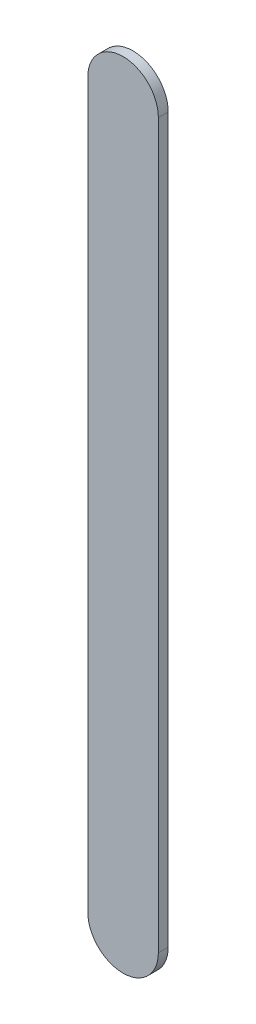
ISO-10303-21;
HEADER;
FILE_DESCRIPTION(('STEP AP214'),'2;1');
FILE_NAME('part.step','',(''),(''),'','','');
FILE_SCHEMA(('AUTOMOTIVE_DESIGN { 1 0 10303 214 1 1 1 1 }'));
ENDSEC;
DATA;
#1=APPLICATION_CONTEXT('core data for automotive mechanical design processes');
#2=APPLICATION_PROTOCOL_DEFINITION('international standard','automotive_design',2000,#1);
#3=PRODUCT_CONTEXT('',#1,'mechanical');
#4=PRODUCT('Part','Part','',(#3));
#5=PRODUCT_RELATED_PRODUCT_CATEGORY('part','',(#4));
#6=PRODUCT_DEFINITION_FORMATION('','',#4);
#7=PRODUCT_DEFINITION_CONTEXT('part definition',#1,'design');
#8=PRODUCT_DEFINITION('design','',#6,#7);
#9=PRODUCT_DEFINITION_SHAPE('','',#8);
#10=(LENGTH_UNIT() NAMED_UNIT(*) SI_UNIT(.MILLI.,.METRE.));
#11=(NAMED_UNIT(*) PLANE_ANGLE_UNIT() SI_UNIT($,.RADIAN.));
#12=(NAMED_UNIT(*) SI_UNIT($,.STERADIAN.) SOLID_ANGLE_UNIT());
#13=UNCERTAINTY_MEASURE_WITH_UNIT(LENGTH_MEASURE(1.E-05),#10,'distance_accuracy_value','');
#14=(GEOMETRIC_REPRESENTATION_CONTEXT(3) GLOBAL_UNCERTAINTY_ASSIGNED_CONTEXT((#13)) GLOBAL_UNIT_ASSIGNED_CONTEXT((#10,
#11,#12)) REPRESENTATION_CONTEXT('',''));
#15=CARTESIAN_POINT('',(0.,0.,0.));
#16=DIRECTION('',(0.,0.,1.));
#17=DIRECTION('',(1.,0.,0.));
#18=AXIS2_PLACEMENT_3D('',#15,#16,#17);
#19=CARTESIAN_POINT('',(90.6440148,97.48693228,0.));
#20=DIRECTION('',(-1.,0.,0.));
#21=DIRECTION('',(0.,1.,0.));
#22=AXIS2_PLACEMENT_3D('',#19,#20,#21);
#23=PLANE('',#22);
#24=DIRECTION('',(0.,1.,0.));
#25=VECTOR('',#24,1.);
#26=CARTESIAN_POINT('',(90.6440148,97.48693228,0.03556));
#27=LINE('',#26,#25);
#28=CARTESIAN_POINT('',(90.6440148,97.48693228,0.03556));
#29=VERTEX_POINT('',#28);
#30=CARTESIAN_POINT('',(90.6440148,100.0900208,0.03556));
#31=VERTEX_POINT('',#30);
#32=EDGE_CURVE('E11',#29,#31,#27,.T.);
#33=ORIENTED_EDGE('',*,*,#32,.F.);
#34=DIRECTION('',(0.,0.,1.));
#35=VECTOR('',#34,1.);
#36=CARTESIAN_POINT('',(90.6440148,97.48693228,0.));
#37=LINE('',#36,#35);
#38=CARTESIAN_POINT('',(90.6440148,97.48693228,0.));
#39=VERTEX_POINT('',#38);
#40=EDGE_CURVE('E24',#39,#29,#37,.T.);
#41=ORIENTED_EDGE('',*,*,#40,.F.);
#42=DIRECTION('',(0.,1.,0.));
#43=VECTOR('',#42,1.);
#44=CARTESIAN_POINT('',(90.6440148,97.48693228,0.));
#45=LINE('',#44,#43);
#46=CARTESIAN_POINT('',(90.6440148,100.0900208,0.));
#47=VERTEX_POINT('',#46);
#48=EDGE_CURVE('E75',#39,#47,#45,.T.);
#49=ORIENTED_EDGE('',*,*,#48,.T.);
#50=DIRECTION('',(0.,0.,1.));
#51=VECTOR('',#50,1.);
#52=CARTESIAN_POINT('',(90.6440148,100.0900208,0.));
#53=LINE('',#52,#51);
#54=EDGE_CURVE('E37',#47,#31,#53,.T.);
#55=ORIENTED_EDGE('',*,*,#54,.T.);
#56=EDGE_LOOP('',(#33,#41,#49,#55));
#57=FACE_BOUND('',#56,.T.);
#58=ADVANCED_FACE('F17',(#57),#23,.F.);
#59=CARTESIAN_POINT('',(90.5170148,100.0900208,0.));
#60=DIRECTION('',(0.,0.,-1.));
#61=DIRECTION('',(1.,1.11896493820492E-13,0.));
#62=AXIS2_PLACEMENT_3D('',#59,#60,#61);
#63=CYLINDRICAL_SURFACE('',#62,0.127000000000005);
#64=CARTESIAN_POINT('',(90.5170148,100.0900208,0.03556));
#65=DIRECTION('',(0.,0.,1.));
#66=DIRECTION('',(1.,1.11896493820492E-13,0.));
#67=AXIS2_PLACEMENT_3D('',#64,#65,#66);
#68=CIRCLE('',#67,0.127000000000005);
#69=CARTESIAN_POINT('',(90.3900148,100.0900208,0.03556));
#70=VERTEX_POINT('',#69);
#71=EDGE_CURVE('E83',#31,#70,#68,.T.);
#72=ORIENTED_EDGE('',*,*,#71,.F.);
#73=ORIENTED_EDGE('',*,*,#54,.F.);
#74=CARTESIAN_POINT('',(90.5170148,100.0900208,0.));
#75=DIRECTION('',(0.,0.,1.));
#76=DIRECTION('',(1.,1.11896493820492E-13,0.));
#77=AXIS2_PLACEMENT_3D('',#74,#75,#76);
#78=CIRCLE('',#77,0.127000000000005);
#79=CARTESIAN_POINT('',(90.3900148,100.0900208,0.));
#80=VERTEX_POINT('',#79);
#81=EDGE_CURVE('E81',#47,#80,#78,.T.);
#82=ORIENTED_EDGE('',*,*,#81,.T.);
#83=DIRECTION('',(0.,0.,1.));
#84=VECTOR('',#83,1.);
#85=CARTESIAN_POINT('',(90.3900148,100.0900208,0.));
#86=LINE('',#85,#84);
#87=EDGE_CURVE('E67',#80,#70,#86,.T.);
#88=ORIENTED_EDGE('',*,*,#87,.T.);
#89=EDGE_LOOP('',(#72,#73,#82,#88));
#90=FACE_BOUND('',#89,.T.);
#91=ADVANCED_FACE('F89',(#90),#63,.T.);
#92=CARTESIAN_POINT('',(90.3900148,100.0900208,0.));
#93=DIRECTION('',(1.,0.,0.));
#94=DIRECTION('',(0.,-1.,0.));
#95=AXIS2_PLACEMENT_3D('',#92,#93,#94);
#96=PLANE('',#95);
#97=DIRECTION('',(0.,-1.,0.));
#98=VECTOR('',#97,1.);
#99=CARTESIAN_POINT('',(90.3900148,100.0900208,0.03556));
#100=LINE('',#99,#98);
#101=CARTESIAN_POINT('',(90.3900148,97.48693228,0.03556));
#102=VERTEX_POINT('',#101);
#103=EDGE_CURVE('E71',#70,#102,#100,.T.);
#104=ORIENTED_EDGE('',*,*,#103,.F.);
#105=ORIENTED_EDGE('',*,*,#87,.F.);
#106=DIRECTION('',(0.,-1.,0.));
#107=VECTOR('',#106,1.);
#108=CARTESIAN_POINT('',(90.3900148,100.0900208,0.));
#109=LINE('',#108,#107);
#110=CARTESIAN_POINT('',(90.3900148,97.48693228,0.));
#111=VERTEX_POINT('',#110);
#112=EDGE_CURVE('E63',#80,#111,#109,.T.);
#113=ORIENTED_EDGE('',*,*,#112,.T.);
#114=DIRECTION('',(0.,0.,1.));
#115=VECTOR('',#114,1.);
#116=CARTESIAN_POINT('',(90.3900148,97.48693228,0.));
#117=LINE('',#116,#115);
#118=EDGE_CURVE('E53',#111,#102,#117,.T.);
#119=ORIENTED_EDGE('',*,*,#118,.T.);
#120=EDGE_LOOP('',(#104,#105,#113,#119));
#121=FACE_BOUND('',#120,.T.);
#122=ADVANCED_FACE('F66',(#121),#96,.F.);
#123=CARTESIAN_POINT('',(90.5170148,97.48693228,0.));
#124=DIRECTION('',(0.,0.,-1.));
#125=DIRECTION('',(-1.,0.,0.));
#126=AXIS2_PLACEMENT_3D('',#123,#124,#125);
#127=CYLINDRICAL_SURFACE('',#126,0.127);
#128=CARTESIAN_POINT('',(90.5170148,97.48693228,0.03556));
#129=DIRECTION('',(0.,0.,1.));
#130=DIRECTION('',(-1.,0.,0.));
#131=AXIS2_PLACEMENT_3D('',#128,#129,#130);
#132=CIRCLE('',#131,0.127);
#133=EDGE_CURVE('E59',#102,#29,#132,.T.);
#134=ORIENTED_EDGE('',*,*,#133,.F.);
#135=ORIENTED_EDGE('',*,*,#118,.F.);
#136=CARTESIAN_POINT('',(90.5170148,97.48693228,0.));
#137=DIRECTION('',(0.,0.,1.));
#138=DIRECTION('',(-1.,0.,0.));
#139=AXIS2_PLACEMENT_3D('',#136,#137,#138);
#140=CIRCLE('',#139,0.127);
#141=EDGE_CURVE('E57',#111,#39,#140,.T.);
#142=ORIENTED_EDGE('',*,*,#141,.T.);
#143=ORIENTED_EDGE('',*,*,#40,.T.);
#144=EDGE_LOOP('',(#134,#135,#142,#143));
#145=FACE_BOUND('',#144,.T.);
#146=ADVANCED_FACE('F55',(#145),#127,.T.);
#147=CARTESIAN_POINT('',(90.6440148,97.48693228,0.));
#148=DIRECTION('',(0.,0.,-1.));
#149=DIRECTION('',(-1.,0.,0.));
#150=AXIS2_PLACEMENT_3D('',#147,#148,#149);
#151=PLANE('',#150);
#152=ORIENTED_EDGE('',*,*,#141,.F.);
#153=ORIENTED_EDGE('',*,*,#112,.F.);
#154=ORIENTED_EDGE('',*,*,#81,.F.);
#155=ORIENTED_EDGE('',*,*,#48,.F.);
#156=EDGE_LOOP('',(#152,#153,#154,#155));
#157=FACE_BOUND('',#156,.T.);
#158=ADVANCED_FACE('F74',(#157),#151,.T.);
#159=CARTESIAN_POINT('',(90.6440148,97.48693228,0.03556));
#160=DIRECTION('',(0.,0.,-1.));
#161=DIRECTION('',(-1.,0.,0.));
#162=AXIS2_PLACEMENT_3D('',#159,#160,#161);
#163=PLANE('',#162);
#164=ORIENTED_EDGE('',*,*,#32,.T.);
#165=ORIENTED_EDGE('',*,*,#71,.T.);
#166=ORIENTED_EDGE('',*,*,#103,.T.);
#167=ORIENTED_EDGE('',*,*,#133,.T.);
#168=EDGE_LOOP('',(#164,#165,#166,#167));
#169=FACE_BOUND('',#168,.T.);
#170=ADVANCED_FACE('F91',(#169),#163,.F.);
#171=CLOSED_SHELL('',(#58,#91,#122,#146,#158,#170));
#172=MANIFOLD_SOLID_BREP('B1',#171);
#173=ADVANCED_BREP_SHAPE_REPRESENTATION('',(#18,#172),#14);
#174=SHAPE_DEFINITION_REPRESENTATION(#9,#173);
ENDSEC;
END-ISO-10303-21;
